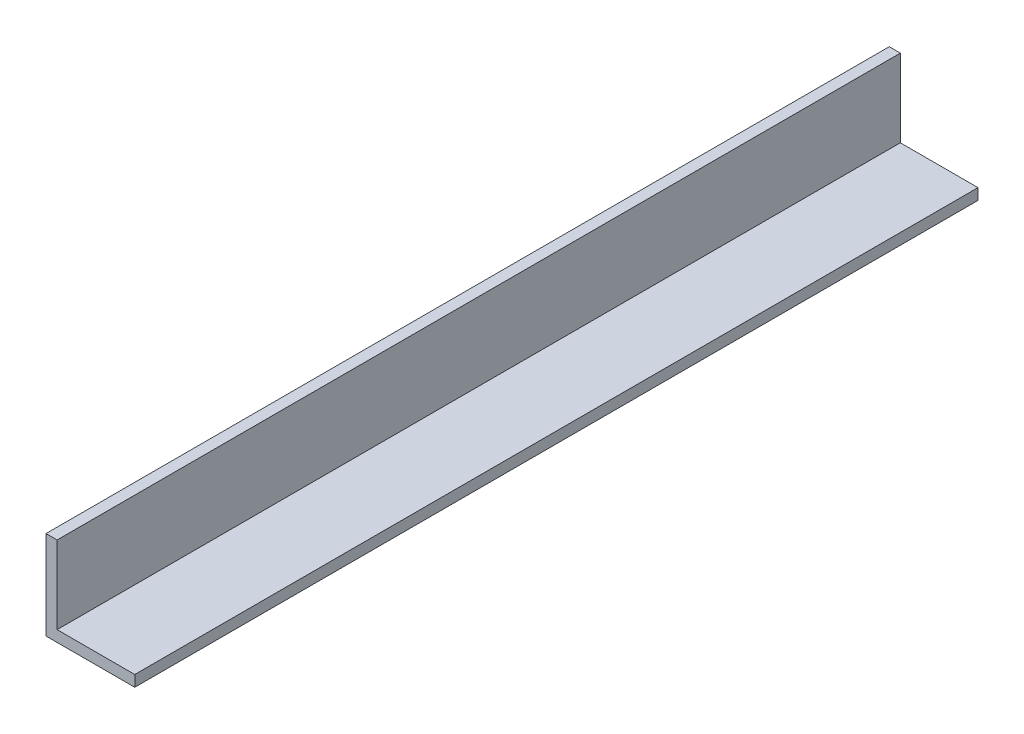
ISO-10303-21;
HEADER;
FILE_DESCRIPTION(('STEP AP214'),'2;1');
FILE_NAME('part.step','',(''),(''),'','','');
FILE_SCHEMA(('AUTOMOTIVE_DESIGN { 1 0 10303 214 1 1 1 1 }'));
ENDSEC;
DATA;
#1=APPLICATION_CONTEXT('core data for automotive mechanical design processes');
#2=APPLICATION_PROTOCOL_DEFINITION('international standard','automotive_design',2000,#1);
#3=PRODUCT_CONTEXT('',#1,'mechanical');
#4=PRODUCT('Part','Part','',(#3));
#5=PRODUCT_RELATED_PRODUCT_CATEGORY('part','',(#4));
#6=PRODUCT_DEFINITION_FORMATION('','',#4);
#7=PRODUCT_DEFINITION_CONTEXT('part definition',#1,'design');
#8=PRODUCT_DEFINITION('design','',#6,#7);
#9=PRODUCT_DEFINITION_SHAPE('','',#8);
#10=(LENGTH_UNIT() NAMED_UNIT(*) SI_UNIT(.MILLI.,.METRE.));
#11=(NAMED_UNIT(*) PLANE_ANGLE_UNIT() SI_UNIT($,.RADIAN.));
#12=(NAMED_UNIT(*) SI_UNIT($,.STERADIAN.) SOLID_ANGLE_UNIT());
#13=UNCERTAINTY_MEASURE_WITH_UNIT(LENGTH_MEASURE(1.E-05),#10,'distance_accuracy_value','');
#14=(GEOMETRIC_REPRESENTATION_CONTEXT(3) GLOBAL_UNCERTAINTY_ASSIGNED_CONTEXT((#13)) GLOBAL_UNIT_ASSIGNED_CONTEXT((#10,
#11,#12)) REPRESENTATION_CONTEXT('',''));
#15=CARTESIAN_POINT('',(0.,0.,0.));
#16=DIRECTION('',(0.,0.,1.));
#17=DIRECTION('',(1.,0.,0.));
#18=AXIS2_PLACEMENT_3D('',#15,#16,#17);
#19=CARTESIAN_POINT('',(0.,0.,241.3));
#20=DIRECTION('',(-1.,0.,0.));
#21=DIRECTION('',(0.,0.,1.));
#22=AXIS2_PLACEMENT_3D('',#19,#20,#21);
#23=PLANE('',#22);
#24=DIRECTION('',(0.,1.,0.));
#25=VECTOR('',#24,1.);
#26=CARTESIAN_POINT('',(0.,0.,0.));
#27=LINE('',#26,#25);
#28=CARTESIAN_POINT('',(0.,0.,0.));
#29=VERTEX_POINT('',#28);
#30=CARTESIAN_POINT('',(0.,25.4,0.));
#31=VERTEX_POINT('',#30);
#32=EDGE_CURVE('E130',#29,#31,#27,.T.);
#33=ORIENTED_EDGE('',*,*,#32,.F.);
#34=DIRECTION('',(0.,0.,-1.));
#35=VECTOR('',#34,1.);
#36=CARTESIAN_POINT('',(0.,0.,241.3));
#37=LINE('',#36,#35);
#38=CARTESIAN_POINT('',(0.,0.,241.3));
#39=VERTEX_POINT('',#38);
#40=EDGE_CURVE('E11',#39,#29,#37,.T.);
#41=ORIENTED_EDGE('',*,*,#40,.F.);
#42=DIRECTION('',(0.,1.,0.));
#43=VECTOR('',#42,1.);
#44=CARTESIAN_POINT('',(0.,0.,241.3));
#45=LINE('',#44,#43);
#46=CARTESIAN_POINT('',(0.,25.4,241.3));
#47=VERTEX_POINT('',#46);
#48=EDGE_CURVE('E149',#39,#47,#45,.T.);
#49=ORIENTED_EDGE('',*,*,#48,.T.);
#50=DIRECTION('',(0.,0.,-1.));
#51=VECTOR('',#50,1.);
#52=CARTESIAN_POINT('',(0.,25.4,241.3));
#53=LINE('',#52,#51);
#54=EDGE_CURVE('E58',#47,#31,#53,.T.);
#55=ORIENTED_EDGE('',*,*,#54,.T.);
#56=EDGE_LOOP('',(#33,#41,#49,#55));
#57=FACE_BOUND('',#56,.T.);
#58=ADVANCED_FACE('F41',(#57),#23,.T.);
#59=CARTESIAN_POINT('',(0.,0.,241.3));
#60=DIRECTION('',(0.,1.,0.));
#61=DIRECTION('',(0.,0.,1.));
#62=AXIS2_PLACEMENT_3D('',#59,#60,#61);
#63=PLANE('',#62);
#64=DIRECTION('',(1.,0.,0.));
#65=VECTOR('',#64,1.);
#66=CARTESIAN_POINT('',(0.,0.,0.));
#67=LINE('',#66,#65);
#68=CARTESIAN_POINT('',(25.4,0.,0.));
#69=VERTEX_POINT('',#68);
#70=EDGE_CURVE('E133',#29,#69,#67,.T.);
#71=ORIENTED_EDGE('',*,*,#70,.T.);
#72=DIRECTION('',(0.,0.,-1.));
#73=VECTOR('',#72,1.);
#74=CARTESIAN_POINT('',(25.4,0.,241.3));
#75=LINE('',#74,#73);
#76=CARTESIAN_POINT('',(25.4,0.,241.3));
#77=VERTEX_POINT('',#76);
#78=EDGE_CURVE('E50',#77,#69,#75,.T.);
#79=ORIENTED_EDGE('',*,*,#78,.F.);
#80=DIRECTION('',(1.,0.,0.));
#81=VECTOR('',#80,1.);
#82=CARTESIAN_POINT('',(0.,0.,241.3));
#83=LINE('',#82,#81);
#84=EDGE_CURVE('E124',#39,#77,#83,.T.);
#85=ORIENTED_EDGE('',*,*,#84,.F.);
#86=ORIENTED_EDGE('',*,*,#40,.T.);
#87=EDGE_LOOP('',(#71,#79,#85,#86));
#88=FACE_BOUND('',#87,.T.);
#89=ADVANCED_FACE('F176',(#88),#63,.F.);
#90=CARTESIAN_POINT('',(25.4,0.,241.3));
#91=DIRECTION('',(-1.,0.,0.));
#92=DIRECTION('',(0.,0.,1.));
#93=AXIS2_PLACEMENT_3D('',#90,#91,#92);
#94=PLANE('',#93);
#95=DIRECTION('',(0.,1.,0.));
#96=VECTOR('',#95,1.);
#97=CARTESIAN_POINT('',(25.4,0.,0.));
#98=LINE('',#97,#96);
#99=CARTESIAN_POINT('',(25.4,3.175,0.));
#100=VERTEX_POINT('',#99);
#101=EDGE_CURVE('E136',#69,#100,#98,.T.);
#102=ORIENTED_EDGE('',*,*,#101,.T.);
#103=DIRECTION('',(0.,0.,-1.));
#104=VECTOR('',#103,1.);
#105=CARTESIAN_POINT('',(25.4,3.175,241.3));
#106=LINE('',#105,#104);
#107=CARTESIAN_POINT('',(25.4,3.175,241.3));
#108=VERTEX_POINT('',#107);
#109=EDGE_CURVE('E107',#108,#100,#106,.T.);
#110=ORIENTED_EDGE('',*,*,#109,.F.);
#111=DIRECTION('',(0.,1.,0.));
#112=VECTOR('',#111,1.);
#113=CARTESIAN_POINT('',(25.4,0.,241.3));
#114=LINE('',#113,#112);
#115=EDGE_CURVE('E119',#77,#108,#114,.T.);
#116=ORIENTED_EDGE('',*,*,#115,.F.);
#117=ORIENTED_EDGE('',*,*,#78,.T.);
#118=EDGE_LOOP('',(#102,#110,#116,#117));
#119=FACE_BOUND('',#118,.T.);
#120=ADVANCED_FACE('F160',(#119),#94,.F.);
#121=CARTESIAN_POINT('',(0.,3.175,241.3));
#122=DIRECTION('',(0.,1.,0.));
#123=DIRECTION('',(0.,0.,1.));
#124=AXIS2_PLACEMENT_3D('',#121,#122,#123);
#125=PLANE('',#124);
#126=DIRECTION('',(1.,0.,0.));
#127=VECTOR('',#126,1.);
#128=CARTESIAN_POINT('',(0.,3.175,0.));
#129=LINE('',#128,#127);
#130=CARTESIAN_POINT('',(3.175,3.175,0.));
#131=VERTEX_POINT('',#130);
#132=EDGE_CURVE('E103',#131,#100,#129,.T.);
#133=ORIENTED_EDGE('',*,*,#132,.F.);
#134=DIRECTION('',(0.,0.,-1.));
#135=VECTOR('',#134,1.);
#136=CARTESIAN_POINT('',(3.175,3.175,241.3));
#137=LINE('',#136,#135);
#138=CARTESIAN_POINT('',(3.175,3.175,241.3));
#139=VERTEX_POINT('',#138);
#140=EDGE_CURVE('E97',#139,#131,#137,.T.);
#141=ORIENTED_EDGE('',*,*,#140,.F.);
#142=DIRECTION('',(1.,0.,0.));
#143=VECTOR('',#142,1.);
#144=CARTESIAN_POINT('',(0.,3.175,241.3));
#145=LINE('',#144,#143);
#146=EDGE_CURVE('E101',#139,#108,#145,.T.);
#147=ORIENTED_EDGE('',*,*,#146,.T.);
#148=ORIENTED_EDGE('',*,*,#109,.T.);
#149=EDGE_LOOP('',(#133,#141,#147,#148));
#150=FACE_BOUND('',#149,.T.);
#151=ADVANCED_FACE('F99',(#150),#125,.T.);
#152=CARTESIAN_POINT('',(3.175,0.,241.3));
#153=DIRECTION('',(-1.,0.,0.));
#154=DIRECTION('',(0.,0.,1.));
#155=AXIS2_PLACEMENT_3D('',#152,#153,#154);
#156=PLANE('',#155);
#157=DIRECTION('',(0.,1.,0.));
#158=VECTOR('',#157,1.);
#159=CARTESIAN_POINT('',(3.175,0.,0.));
#160=LINE('',#159,#158);
#161=CARTESIAN_POINT('',(3.175,25.4,0.));
#162=VERTEX_POINT('',#161);
#163=EDGE_CURVE('E142',#131,#162,#160,.T.);
#164=ORIENTED_EDGE('',*,*,#163,.T.);
#165=DIRECTION('',(0.,0.,-1.));
#166=VECTOR('',#165,1.);
#167=CARTESIAN_POINT('',(3.175,25.4,241.3));
#168=LINE('',#167,#166);
#169=CARTESIAN_POINT('',(3.175,25.4,241.3));
#170=VERTEX_POINT('',#169);
#171=EDGE_CURVE('E78',#170,#162,#168,.T.);
#172=ORIENTED_EDGE('',*,*,#171,.F.);
#173=DIRECTION('',(0.,1.,0.));
#174=VECTOR('',#173,1.);
#175=CARTESIAN_POINT('',(3.175,0.,241.3));
#176=LINE('',#175,#174);
#177=EDGE_CURVE('E109',#139,#170,#176,.T.);
#178=ORIENTED_EDGE('',*,*,#177,.F.);
#179=ORIENTED_EDGE('',*,*,#140,.T.);
#180=EDGE_LOOP('',(#164,#172,#178,#179));
#181=FACE_BOUND('',#180,.T.);
#182=ADVANCED_FACE('F110',(#181),#156,.F.);
#183=CARTESIAN_POINT('',(0.,25.4,241.3));
#184=DIRECTION('',(0.,1.,0.));
#185=DIRECTION('',(0.,0.,1.));
#186=AXIS2_PLACEMENT_3D('',#183,#184,#185);
#187=PLANE('',#186);
#188=DIRECTION('',(1.,0.,0.));
#189=VECTOR('',#188,1.);
#190=CARTESIAN_POINT('',(0.,25.4,0.));
#191=LINE('',#190,#189);
#192=EDGE_CURVE('E145',#31,#162,#191,.T.);
#193=ORIENTED_EDGE('',*,*,#192,.F.);
#194=ORIENTED_EDGE('',*,*,#54,.F.);
#195=DIRECTION('',(1.,0.,0.));
#196=VECTOR('',#195,1.);
#197=CARTESIAN_POINT('',(0.,25.4,241.3));
#198=LINE('',#197,#196);
#199=EDGE_CURVE('E114',#47,#170,#198,.T.);
#200=ORIENTED_EDGE('',*,*,#199,.T.);
#201=ORIENTED_EDGE('',*,*,#171,.T.);
#202=EDGE_LOOP('',(#193,#194,#200,#201));
#203=FACE_BOUND('',#202,.T.);
#204=ADVANCED_FACE('F165',(#203),#187,.T.);
#205=CARTESIAN_POINT('',(0.,0.,241.3));
#206=DIRECTION('',(0.,0.,1.));
#207=DIRECTION('',(1.,0.,0.));
#208=AXIS2_PLACEMENT_3D('',#205,#206,#207);
#209=PLANE('',#208);
#210=ORIENTED_EDGE('',*,*,#48,.F.);
#211=ORIENTED_EDGE('',*,*,#84,.T.);
#212=ORIENTED_EDGE('',*,*,#115,.T.);
#213=ORIENTED_EDGE('',*,*,#146,.F.);
#214=ORIENTED_EDGE('',*,*,#177,.T.);
#215=ORIENTED_EDGE('',*,*,#199,.F.);
#216=EDGE_LOOP('',(#210,#211,#212,#213,#214,#215));
#217=FACE_BOUND('',#216,.T.);
#218=ADVANCED_FACE('F117',(#217),#209,.T.);
#219=CARTESIAN_POINT('',(0.,0.,0.));
#220=DIRECTION('',(0.,0.,1.));
#221=DIRECTION('',(1.,0.,0.));
#222=AXIS2_PLACEMENT_3D('',#219,#220,#221);
#223=PLANE('',#222);
#224=ORIENTED_EDGE('',*,*,#32,.T.);
#225=ORIENTED_EDGE('',*,*,#192,.T.);
#226=ORIENTED_EDGE('',*,*,#163,.F.);
#227=ORIENTED_EDGE('',*,*,#132,.T.);
#228=ORIENTED_EDGE('',*,*,#101,.F.);
#229=ORIENTED_EDGE('',*,*,#70,.F.);
#230=EDGE_LOOP('',(#224,#225,#226,#227,#228,#229));
#231=FACE_BOUND('',#230,.T.);
#232=ADVANCED_FACE('F164',(#231),#223,.F.);
#233=CLOSED_SHELL('',(#58,#89,#120,#151,#182,#204,#218,#232));
#234=MANIFOLD_SOLID_BREP('B2',#233);
#235=ADVANCED_BREP_SHAPE_REPRESENTATION('',(#18,#234),#14);
#236=SHAPE_DEFINITION_REPRESENTATION(#9,#235);
ENDSEC;
END-ISO-10303-21;
